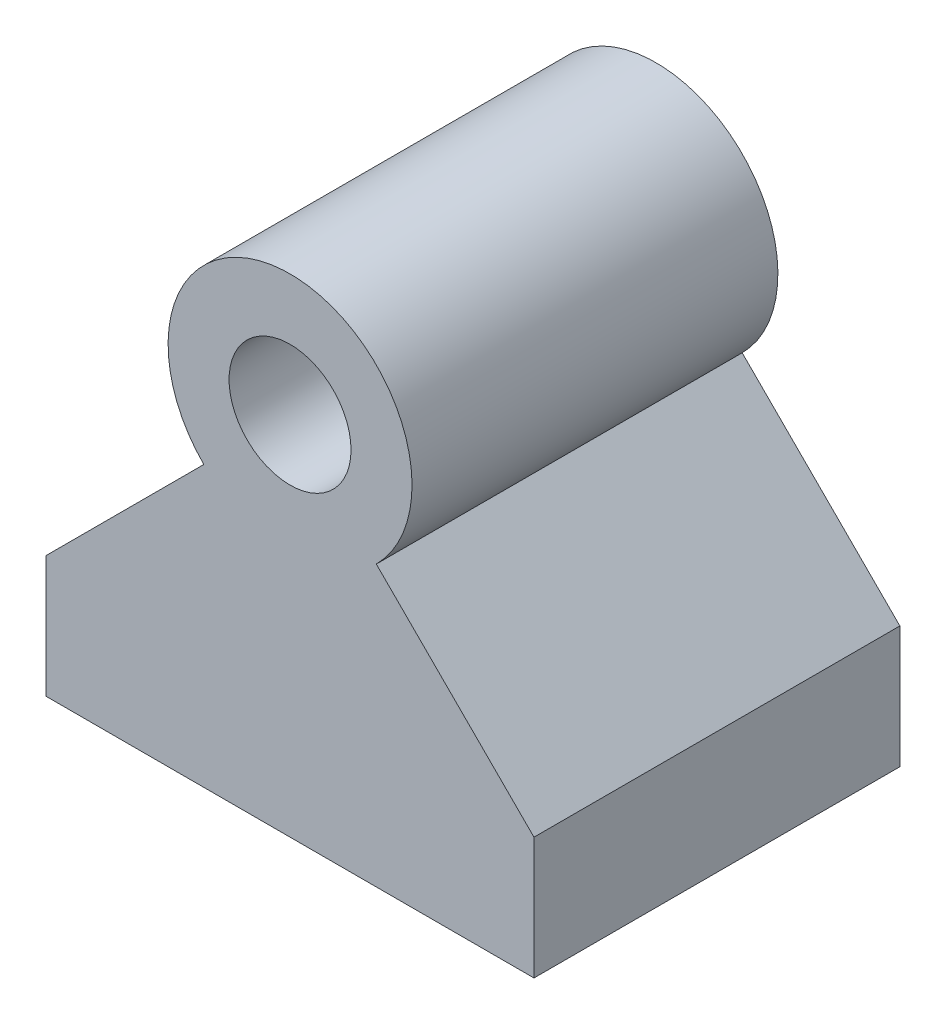
ISO-10303-21;
HEADER;
FILE_DESCRIPTION(('STEP AP214'),'2;1');
FILE_NAME('part.step','',(''),(''),'','','');
FILE_SCHEMA(('AUTOMOTIVE_DESIGN { 1 0 10303 214 1 1 1 1 }'));
ENDSEC;
DATA;
#1=APPLICATION_CONTEXT('core data for automotive mechanical design processes');
#2=APPLICATION_PROTOCOL_DEFINITION('international standard','automotive_design',2000,#1);
#3=PRODUCT_CONTEXT('',#1,'mechanical');
#4=PRODUCT('Part','Part','',(#3));
#5=PRODUCT_RELATED_PRODUCT_CATEGORY('part','',(#4));
#6=PRODUCT_DEFINITION_FORMATION('','',#4);
#7=PRODUCT_DEFINITION_CONTEXT('part definition',#1,'design');
#8=PRODUCT_DEFINITION('design','',#6,#7);
#9=PRODUCT_DEFINITION_SHAPE('','',#8);
#10=(LENGTH_UNIT() NAMED_UNIT(*) SI_UNIT(.MILLI.,.METRE.));
#11=(NAMED_UNIT(*) PLANE_ANGLE_UNIT() SI_UNIT($,.RADIAN.));
#12=(NAMED_UNIT(*) SI_UNIT($,.STERADIAN.) SOLID_ANGLE_UNIT());
#13=UNCERTAINTY_MEASURE_WITH_UNIT(LENGTH_MEASURE(1.E-05),#10,'distance_accuracy_value','');
#14=(GEOMETRIC_REPRESENTATION_CONTEXT(3) GLOBAL_UNCERTAINTY_ASSIGNED_CONTEXT((#13)) GLOBAL_UNIT_ASSIGNED_CONTEXT((#10,
#11,#12)) REPRESENTATION_CONTEXT('',''));
#15=CARTESIAN_POINT('',(0.,0.,0.));
#16=DIRECTION('',(0.,0.,1.));
#17=DIRECTION('',(1.,0.,0.));
#18=AXIS2_PLACEMENT_3D('',#15,#16,#17);
#19=CARTESIAN_POINT('',(0.,30.,15.));
#20=DIRECTION('',(0.,0.,1.));
#21=DIRECTION('',(1.,0.,0.));
#22=AXIS2_PLACEMENT_3D('',#19,#20,#21);
#23=PLANE('',#22);
#24=DIRECTION('',(0.,-1.,0.));
#25=VECTOR('',#24,1.);
#26=CARTESIAN_POINT('',(-20.,9.99999999999993,15.));
#27=LINE('',#26,#25);
#28=CARTESIAN_POINT('',(-20.,9.99999999999993,15.));
#29=VERTEX_POINT('',#28);
#30=CARTESIAN_POINT('',(-20.,0.,15.));
#31=VERTEX_POINT('',#30);
#32=EDGE_CURVE('E146',#29,#31,#27,.T.);
#33=ORIENTED_EDGE('',*,*,#32,.T.);
#34=DIRECTION('',(1.,0.,0.));
#35=VECTOR('',#34,1.);
#36=CARTESIAN_POINT('',(-20.,0.,15.));
#37=LINE('',#36,#35);
#38=CARTESIAN_POINT('',(20.,0.,15.));
#39=VERTEX_POINT('',#38);
#40=EDGE_CURVE('E94',#31,#39,#37,.T.);
#41=ORIENTED_EDGE('',*,*,#40,.T.);
#42=DIRECTION('',(0.,1.,0.));
#43=VECTOR('',#42,1.);
#44=CARTESIAN_POINT('',(20.,0.,15.));
#45=LINE('',#44,#43);
#46=CARTESIAN_POINT('',(20.,9.99999999999993,15.));
#47=VERTEX_POINT('',#46);
#48=EDGE_CURVE('E107',#39,#47,#45,.T.);
#49=ORIENTED_EDGE('',*,*,#48,.T.);
#50=DIRECTION('',(-0.707106781186546,0.707106781186549,0.));
#51=VECTOR('',#50,1.);
#52=CARTESIAN_POINT('',(20.,9.99999999999993,15.));
#53=LINE('',#52,#51);
#54=CARTESIAN_POINT('',(7.07106781186547,22.9289321881345,15.));
#55=VERTEX_POINT('',#54);
#56=EDGE_CURVE('E101',#47,#55,#53,.T.);
#57=ORIENTED_EDGE('',*,*,#56,.T.);
#58=CARTESIAN_POINT('',(0.,30.,15.));
#59=DIRECTION('',(0.,0.,1.));
#60=DIRECTION('',(1.,0.,0.));
#61=AXIS2_PLACEMENT_3D('',#58,#59,#60);
#62=CIRCLE('',#61,10.);
#63=CARTESIAN_POINT('',(-7.07106781186547,22.9289321881345,15.));
#64=VERTEX_POINT('',#63);
#65=EDGE_CURVE('E105',#55,#64,#62,.T.);
#66=ORIENTED_EDGE('',*,*,#65,.T.);
#67=DIRECTION('',(-0.707106781186546,-0.707106781186549,0.));
#68=VECTOR('',#67,1.);
#69=CARTESIAN_POINT('',(-7.07106781186547,22.9289321881345,15.));
#70=LINE('',#69,#68);
#71=EDGE_CURVE('E57',#64,#29,#70,.T.);
#72=ORIENTED_EDGE('',*,*,#71,.T.);
#73=EDGE_LOOP('',(#33,#41,#49,#57,#66,#72));
#74=FACE_BOUND('',#73,.T.);
#75=CARTESIAN_POINT('',(0.,30.,15.));
#76=DIRECTION('',(0.,0.,1.));
#77=DIRECTION('',(1.,0.,0.));
#78=AXIS2_PLACEMENT_3D('',#75,#76,#77);
#79=CIRCLE('',#78,5.);
#80=CARTESIAN_POINT('',(5.,30.,15.));
#81=VERTEX_POINT('',#80);
#82=EDGE_CURVE('E134',#81,#81,#79,.T.);
#83=ORIENTED_EDGE('',*,*,#82,.F.);
#84=EDGE_LOOP('',(#83));
#85=FACE_BOUND('',#84,.T.);
#86=ADVANCED_FACE('F39',(#74,#85),#23,.T.);
#87=CARTESIAN_POINT('',(0.,30.,-15.));
#88=DIRECTION('',(0.,0.,1.));
#89=DIRECTION('',(1.,0.,0.));
#90=AXIS2_PLACEMENT_3D('',#87,#88,#89);
#91=PLANE('',#90);
#92=DIRECTION('',(0.,-1.,0.));
#93=VECTOR('',#92,1.);
#94=CARTESIAN_POINT('',(-20.,9.99999999999993,-15.));
#95=LINE('',#94,#93);
#96=CARTESIAN_POINT('',(-20.,9.99999999999993,-15.));
#97=VERTEX_POINT('',#96);
#98=CARTESIAN_POINT('',(-20.,0.,-15.));
#99=VERTEX_POINT('',#98);
#100=EDGE_CURVE('E129',#97,#99,#95,.T.);
#101=ORIENTED_EDGE('',*,*,#100,.F.);
#102=DIRECTION('',(-0.707106781186546,-0.707106781186549,0.));
#103=VECTOR('',#102,1.);
#104=CARTESIAN_POINT('',(-7.07106781186547,22.9289321881345,-15.));
#105=LINE('',#104,#103);
#106=CARTESIAN_POINT('',(-7.07106781186547,22.9289321881345,-15.));
#107=VERTEX_POINT('',#106);
#108=EDGE_CURVE('E86',#107,#97,#105,.T.);
#109=ORIENTED_EDGE('',*,*,#108,.F.);
#110=CARTESIAN_POINT('',(0.,30.,-15.));
#111=DIRECTION('',(0.,0.,1.));
#112=DIRECTION('',(1.,0.,0.));
#113=AXIS2_PLACEMENT_3D('',#110,#111,#112);
#114=CIRCLE('',#113,10.);
#115=CARTESIAN_POINT('',(7.07106781186547,22.9289321881345,-15.));
#116=VERTEX_POINT('',#115);
#117=EDGE_CURVE('E80',#116,#107,#114,.T.);
#118=ORIENTED_EDGE('',*,*,#117,.F.);
#119=DIRECTION('',(-0.707106781186546,0.707106781186549,0.));
#120=VECTOR('',#119,1.);
#121=CARTESIAN_POINT('',(20.,9.99999999999993,-15.));
#122=LINE('',#121,#120);
#123=CARTESIAN_POINT('',(20.,9.99999999999993,-15.));
#124=VERTEX_POINT('',#123);
#125=EDGE_CURVE('E116',#124,#116,#122,.T.);
#126=ORIENTED_EDGE('',*,*,#125,.F.);
#127=DIRECTION('',(0.,1.,0.));
#128=VECTOR('',#127,1.);
#129=CARTESIAN_POINT('',(20.,0.,-15.));
#130=LINE('',#129,#128);
#131=CARTESIAN_POINT('',(20.,0.,-15.));
#132=VERTEX_POINT('',#131);
#133=EDGE_CURVE('E137',#132,#124,#130,.T.);
#134=ORIENTED_EDGE('',*,*,#133,.F.);
#135=DIRECTION('',(1.,0.,0.));
#136=VECTOR('',#135,1.);
#137=CARTESIAN_POINT('',(-20.,0.,-15.));
#138=LINE('',#137,#136);
#139=EDGE_CURVE('E133',#99,#132,#138,.T.);
#140=ORIENTED_EDGE('',*,*,#139,.F.);
#141=EDGE_LOOP('',(#101,#109,#118,#126,#134,#140));
#142=FACE_BOUND('',#141,.T.);
#143=CARTESIAN_POINT('',(0.,30.,-15.));
#144=DIRECTION('',(0.,0.,1.));
#145=DIRECTION('',(1.,0.,0.));
#146=AXIS2_PLACEMENT_3D('',#143,#144,#145);
#147=CIRCLE('',#146,5.);
#148=CARTESIAN_POINT('',(5.,30.,-15.));
#149=VERTEX_POINT('',#148);
#150=EDGE_CURVE('E243',#149,#149,#147,.T.);
#151=ORIENTED_EDGE('',*,*,#150,.T.);
#152=EDGE_LOOP('',(#151));
#153=FACE_BOUND('',#152,.T.);
#154=ADVANCED_FACE('F159',(#142,#153),#91,.F.);
#155=CARTESIAN_POINT('',(-20.,9.99999999999993,15.));
#156=DIRECTION('',(1.,0.,0.));
#157=DIRECTION('',(0.,0.,-1.));
#158=AXIS2_PLACEMENT_3D('',#155,#156,#157);
#159=PLANE('',#158);
#160=ORIENTED_EDGE('',*,*,#100,.T.);
#161=DIRECTION('',(0.,0.,-1.));
#162=VECTOR('',#161,1.);
#163=CARTESIAN_POINT('',(-20.,0.,15.));
#164=LINE('',#163,#162);
#165=EDGE_CURVE('E11',#31,#99,#164,.T.);
#166=ORIENTED_EDGE('',*,*,#165,.F.);
#167=ORIENTED_EDGE('',*,*,#32,.F.);
#168=DIRECTION('',(0.,0.,-1.));
#169=VECTOR('',#168,1.);
#170=CARTESIAN_POINT('',(-20.,9.99999999999993,15.));
#171=LINE('',#170,#169);
#172=EDGE_CURVE('E125',#29,#97,#171,.T.);
#173=ORIENTED_EDGE('',*,*,#172,.T.);
#174=EDGE_LOOP('',(#160,#166,#167,#173));
#175=FACE_BOUND('',#174,.T.);
#176=ADVANCED_FACE('F41',(#175),#159,.F.);
#177=CARTESIAN_POINT('',(-20.,0.,15.));
#178=DIRECTION('',(0.,1.,0.));
#179=DIRECTION('',(0.,0.,1.));
#180=AXIS2_PLACEMENT_3D('',#177,#178,#179);
#181=PLANE('',#180);
#182=ORIENTED_EDGE('',*,*,#139,.T.);
#183=DIRECTION('',(0.,0.,-1.));
#184=VECTOR('',#183,1.);
#185=CARTESIAN_POINT('',(20.,0.,15.));
#186=LINE('',#185,#184);
#187=EDGE_CURVE('E49',#39,#132,#186,.T.);
#188=ORIENTED_EDGE('',*,*,#187,.F.);
#189=ORIENTED_EDGE('',*,*,#40,.F.);
#190=ORIENTED_EDGE('',*,*,#165,.T.);
#191=EDGE_LOOP('',(#182,#188,#189,#190));
#192=FACE_BOUND('',#191,.T.);
#193=ADVANCED_FACE('F184',(#192),#181,.F.);
#194=CARTESIAN_POINT('',(20.,0.,15.));
#195=DIRECTION('',(-1.,0.,0.));
#196=DIRECTION('',(0.,0.,1.));
#197=AXIS2_PLACEMENT_3D('',#194,#195,#196);
#198=PLANE('',#197);
#199=ORIENTED_EDGE('',*,*,#133,.T.);
#200=DIRECTION('',(0.,0.,-1.));
#201=VECTOR('',#200,1.);
#202=CARTESIAN_POINT('',(20.,9.99999999999993,15.));
#203=LINE('',#202,#201);
#204=EDGE_CURVE('E118',#47,#124,#203,.T.);
#205=ORIENTED_EDGE('',*,*,#204,.F.);
#206=ORIENTED_EDGE('',*,*,#48,.F.);
#207=ORIENTED_EDGE('',*,*,#187,.T.);
#208=EDGE_LOOP('',(#199,#205,#206,#207));
#209=FACE_BOUND('',#208,.T.);
#210=ADVANCED_FACE('F156',(#209),#198,.F.);
#211=CARTESIAN_POINT('',(20.,9.99999999999993,15.));
#212=DIRECTION('',(-0.707106781186549,-0.707106781186546,0.));
#213=DIRECTION('',(0.707106781186546,-0.707106781186549,0.));
#214=AXIS2_PLACEMENT_3D('',#211,#212,#213);
#215=PLANE('',#214);
#216=ORIENTED_EDGE('',*,*,#125,.T.);
#217=DIRECTION('',(0.,0.,-1.));
#218=VECTOR('',#217,1.);
#219=CARTESIAN_POINT('',(7.07106781186547,22.9289321881345,15.));
#220=LINE('',#219,#218);
#221=EDGE_CURVE('E113',#55,#116,#220,.T.);
#222=ORIENTED_EDGE('',*,*,#221,.F.);
#223=ORIENTED_EDGE('',*,*,#56,.F.);
#224=ORIENTED_EDGE('',*,*,#204,.T.);
#225=EDGE_LOOP('',(#216,#222,#223,#224));
#226=FACE_BOUND('',#225,.T.);
#227=ADVANCED_FACE('F114',(#226),#215,.F.);
#228=CARTESIAN_POINT('',(0.,30.,15.));
#229=DIRECTION('',(0.,0.,-1.));
#230=DIRECTION('',(-1.,0.,0.));
#231=AXIS2_PLACEMENT_3D('',#228,#229,#230);
#232=CYLINDRICAL_SURFACE('',#231,10.);
#233=ORIENTED_EDGE('',*,*,#117,.T.);
#234=DIRECTION('',(0.,0.,-1.));
#235=VECTOR('',#234,1.);
#236=CARTESIAN_POINT('',(-7.07106781186547,22.9289321881345,15.));
#237=LINE('',#236,#235);
#238=EDGE_CURVE('E119',#64,#107,#237,.T.);
#239=ORIENTED_EDGE('',*,*,#238,.F.);
#240=ORIENTED_EDGE('',*,*,#65,.F.);
#241=ORIENTED_EDGE('',*,*,#221,.T.);
#242=EDGE_LOOP('',(#233,#239,#240,#241));
#243=FACE_BOUND('',#242,.T.);
#244=ADVANCED_FACE('F121',(#243),#232,.T.);
#245=CARTESIAN_POINT('',(-7.07106781186547,22.9289321881345,15.));
#246=DIRECTION('',(0.707106781186549,-0.707106781186546,0.));
#247=DIRECTION('',(0.707106781186546,0.707106781186549,0.));
#248=AXIS2_PLACEMENT_3D('',#245,#246,#247);
#249=PLANE('',#248);
#250=ORIENTED_EDGE('',*,*,#108,.T.);
#251=ORIENTED_EDGE('',*,*,#172,.F.);
#252=ORIENTED_EDGE('',*,*,#71,.F.);
#253=ORIENTED_EDGE('',*,*,#238,.T.);
#254=EDGE_LOOP('',(#250,#251,#252,#253));
#255=FACE_BOUND('',#254,.T.);
#256=ADVANCED_FACE('F164',(#255),#249,.F.);
#257=CARTESIAN_POINT('',(0.,30.,15.));
#258=DIRECTION('',(0.,0.,-1.));
#259=DIRECTION('',(-1.,0.,0.));
#260=AXIS2_PLACEMENT_3D('',#257,#258,#259);
#261=CYLINDRICAL_SURFACE('',#260,5.);
#262=ORIENTED_EDGE('',*,*,#82,.T.);
#263=EDGE_LOOP('',(#262));
#264=FACE_BOUND('',#263,.T.);
#265=ORIENTED_EDGE('',*,*,#150,.F.);
#266=EDGE_LOOP('',(#265));
#267=FACE_BOUND('',#266,.T.);
#268=ADVANCED_FACE('F166',(#264,#267),#261,.F.);
#269=CLOSED_SHELL('',(#86,#154,#176,#193,#210,#227,#244,#256,#268));
#270=MANIFOLD_SOLID_BREP('B2',#269);
#271=ADVANCED_BREP_SHAPE_REPRESENTATION('',(#18,#270),#14);
#272=SHAPE_DEFINITION_REPRESENTATION(#9,#271);
ENDSEC;
END-ISO-10303-21;
